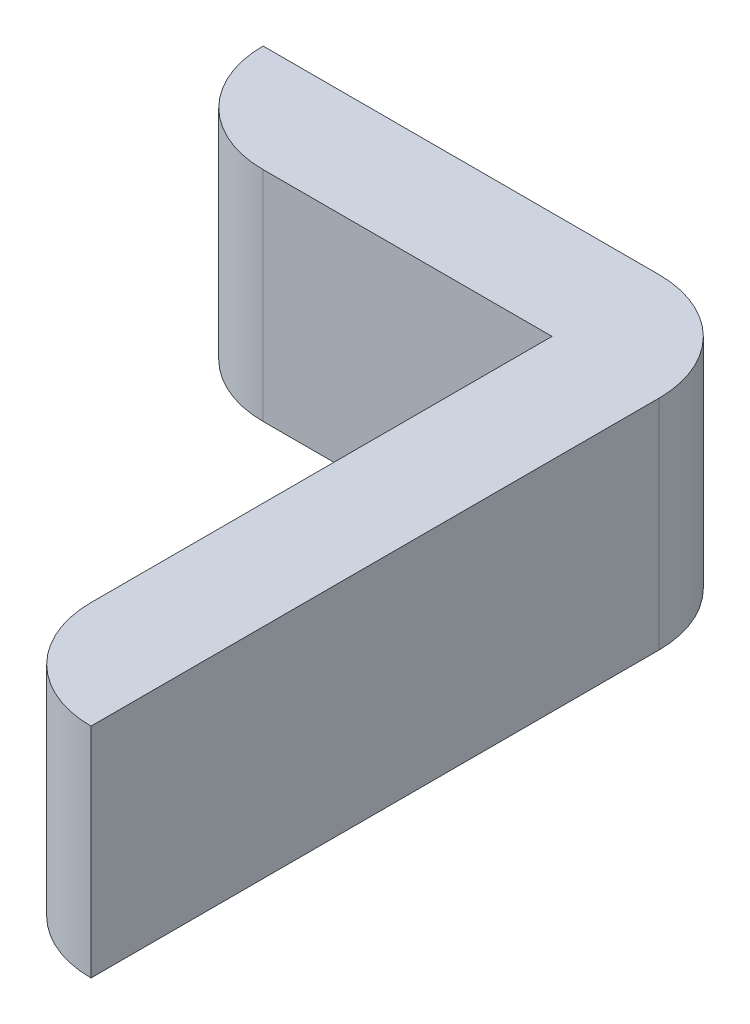
ISO-10303-21;
HEADER;
FILE_DESCRIPTION(('STEP AP214'),'2;1');
FILE_NAME('part.step','',(''),(''),'','','');
FILE_SCHEMA(('AUTOMOTIVE_DESIGN { 1 0 10303 214 1 1 1 1 }'));
ENDSEC;
DATA;
#1=APPLICATION_CONTEXT('core data for automotive mechanical design processes');
#2=APPLICATION_PROTOCOL_DEFINITION('international standard','automotive_design',2000,#1);
#3=PRODUCT_CONTEXT('',#1,'mechanical');
#4=PRODUCT('Part','Part','',(#3));
#5=PRODUCT_RELATED_PRODUCT_CATEGORY('part','',(#4));
#6=PRODUCT_DEFINITION_FORMATION('','',#4);
#7=PRODUCT_DEFINITION_CONTEXT('part definition',#1,'design');
#8=PRODUCT_DEFINITION('design','',#6,#7);
#9=PRODUCT_DEFINITION_SHAPE('','',#8);
#10=(LENGTH_UNIT() NAMED_UNIT(*) SI_UNIT(.MILLI.,.METRE.));
#11=(NAMED_UNIT(*) PLANE_ANGLE_UNIT() SI_UNIT($,.RADIAN.));
#12=(NAMED_UNIT(*) SI_UNIT($,.STERADIAN.) SOLID_ANGLE_UNIT());
#13=UNCERTAINTY_MEASURE_WITH_UNIT(LENGTH_MEASURE(1.E-05),#10,'distance_accuracy_value','');
#14=(GEOMETRIC_REPRESENTATION_CONTEXT(3) GLOBAL_UNCERTAINTY_ASSIGNED_CONTEXT((#13)) GLOBAL_UNIT_ASSIGNED_CONTEXT((#10,
#11,#12)) REPRESENTATION_CONTEXT('',''));
#15=CARTESIAN_POINT('',(0.,0.,0.));
#16=DIRECTION('',(0.,0.,1.));
#17=DIRECTION('',(1.,0.,0.));
#18=AXIS2_PLACEMENT_3D('',#15,#16,#17);
#19=CARTESIAN_POINT('',(9.275,1.5248,0.));
#20=DIRECTION('',(0.,-1.,0.));
#21=DIRECTION('',(0.,0.,-1.));
#22=AXIS2_PLACEMENT_3D('',#19,#20,#21);
#23=PLANE('',#22);
#24=DIRECTION('',(-1.,0.,0.));
#25=VECTOR('',#24,1.);
#26=CARTESIAN_POINT('',(9.525,1.5248,0.25));
#27=LINE('',#26,#25);
#28=CARTESIAN_POINT('',(9.525,1.5248,0.25));
#29=VERTEX_POINT('',#28);
#30=CARTESIAN_POINT('',(10.2,1.5248,0.25));
#31=VERTEX_POINT('',#30);
#32=EDGE_CURVE('E102',#29,#31,#27,.F.);
#33=ORIENTED_EDGE('',*,*,#32,.T.);
#34=DIRECTION('',(0.,0.,-1.));
#35=VECTOR('',#34,1.);
#36=CARTESIAN_POINT('',(10.2,1.5248,0.25));
#37=LINE('',#36,#35);
#38=CARTESIAN_POINT('',(10.2,1.5248,1.327));
#39=VERTEX_POINT('',#38);
#40=EDGE_CURVE('E108',#31,#39,#37,.F.);
#41=ORIENTED_EDGE('',*,*,#40,.T.);
#42=CARTESIAN_POINT('',(10.45,1.5248,1.327));
#43=DIRECTION('',(0.,-1.,0.));
#44=DIRECTION('',(0.,0.,-1.));
#45=AXIS2_PLACEMENT_3D('',#42,#43,#44);
#46=CIRCLE('',#45,0.25);
#47=CARTESIAN_POINT('',(10.45,1.5248,1.577));
#48=VERTEX_POINT('',#47);
#49=EDGE_CURVE('E80',#48,#39,#46,.T.);
#50=ORIENTED_EDGE('',*,*,#49,.F.);
#51=DIRECTION('',(0.,0.,1.));
#52=VECTOR('',#51,1.);
#53=CARTESIAN_POINT('',(10.45,1.5248,1.577));
#54=LINE('',#53,#52);
#55=CARTESIAN_POINT('',(10.45,1.5248,0.25));
#56=VERTEX_POINT('',#55);
#57=EDGE_CURVE('E75',#48,#56,#54,.F.);
#58=ORIENTED_EDGE('',*,*,#57,.T.);
#59=CARTESIAN_POINT('',(10.2,1.5248,0.25));
#60=DIRECTION('',(0.,-1.,0.));
#61=DIRECTION('',(0.,0.,-1.));
#62=AXIS2_PLACEMENT_3D('',#59,#60,#61);
#63=CIRCLE('',#62,0.25);
#64=CARTESIAN_POINT('',(10.2,1.5248,0.));
#65=VERTEX_POINT('',#64);
#66=EDGE_CURVE('E19',#65,#56,#63,.T.);
#67=ORIENTED_EDGE('',*,*,#66,.F.);
#68=DIRECTION('',(1.,0.,0.));
#69=VECTOR('',#68,1.);
#70=CARTESIAN_POINT('',(10.2,1.5248,0.));
#71=LINE('',#70,#69);
#72=CARTESIAN_POINT('',(9.275,1.5248,0.));
#73=VERTEX_POINT('',#72);
#74=EDGE_CURVE('E70',#65,#73,#71,.F.);
#75=ORIENTED_EDGE('',*,*,#74,.T.);
#76=CARTESIAN_POINT('',(9.525,1.5248,0.));
#77=DIRECTION('',(0.,-1.,0.));
#78=DIRECTION('',(0.,0.,-1.));
#79=AXIS2_PLACEMENT_3D('',#76,#77,#78);
#80=CIRCLE('',#79,0.25);
#81=EDGE_CURVE('E121',#29,#73,#80,.T.);
#82=ORIENTED_EDGE('',*,*,#81,.F.);
#83=EDGE_LOOP('',(#33,#41,#50,#58,#67,#75,#82));
#84=FACE_BOUND('',#83,.T.);
#85=ADVANCED_FACE('F16',(#84),#23,.F.);
#86=CARTESIAN_POINT('',(10.2,1.0152,0.));
#87=DIRECTION('',(0.,0.,1.));
#88=DIRECTION('',(1.,0.,0.));
#89=AXIS2_PLACEMENT_3D('',#86,#87,#88);
#90=PLANE('',#89);
#91=DIRECTION('',(0.,-1.,0.));
#92=VECTOR('',#91,1.);
#93=CARTESIAN_POINT('',(9.275,1.0152,0.));
#94=LINE('',#93,#92);
#95=CARTESIAN_POINT('',(9.275,1.0152,0.));
#96=VERTEX_POINT('',#95);
#97=EDGE_CURVE('E123',#73,#96,#94,.T.);
#98=ORIENTED_EDGE('',*,*,#97,.F.);
#99=ORIENTED_EDGE('',*,*,#74,.F.);
#100=DIRECTION('',(0.,-1.,0.));
#101=VECTOR('',#100,1.);
#102=CARTESIAN_POINT('',(10.2,1.0152,0.));
#103=LINE('',#102,#101);
#104=CARTESIAN_POINT('',(10.2,1.0152,0.));
#105=VERTEX_POINT('',#104);
#106=EDGE_CURVE('E92',#105,#65,#103,.F.);
#107=ORIENTED_EDGE('',*,*,#106,.F.);
#108=DIRECTION('',(1.,0.,0.));
#109=VECTOR('',#108,1.);
#110=CARTESIAN_POINT('',(9.275,1.0152,0.));
#111=LINE('',#110,#109);
#112=EDGE_CURVE('E120',#96,#105,#111,.T.);
#113=ORIENTED_EDGE('',*,*,#112,.F.);
#114=EDGE_LOOP('',(#98,#99,#107,#113));
#115=FACE_BOUND('',#114,.T.);
#116=ADVANCED_FACE('F158',(#115),#90,.F.);
#117=CARTESIAN_POINT('',(10.2,1.0152,0.25));
#118=DIRECTION('',(0.,-1.,0.));
#119=DIRECTION('',(0.,0.,-1.));
#120=AXIS2_PLACEMENT_3D('',#117,#118,#119);
#121=CYLINDRICAL_SURFACE('',#120,0.25);
#122=ORIENTED_EDGE('',*,*,#66,.T.);
#123=DIRECTION('',(0.,1.,0.));
#124=VECTOR('',#123,1.);
#125=CARTESIAN_POINT('',(10.45,1.0152,0.25));
#126=LINE('',#125,#124);
#127=CARTESIAN_POINT('',(10.45,1.0152,0.25));
#128=VERTEX_POINT('',#127);
#129=EDGE_CURVE('E86',#56,#128,#126,.F.);
#130=ORIENTED_EDGE('',*,*,#129,.T.);
#131=CARTESIAN_POINT('',(10.2,1.0152,0.25));
#132=DIRECTION('',(0.,-1.,0.));
#133=DIRECTION('',(0.,0.,-1.));
#134=AXIS2_PLACEMENT_3D('',#131,#132,#133);
#135=CIRCLE('',#134,0.25);
#136=EDGE_CURVE('E118',#105,#128,#135,.T.);
#137=ORIENTED_EDGE('',*,*,#136,.F.);
#138=ORIENTED_EDGE('',*,*,#106,.T.);
#139=EDGE_LOOP('',(#122,#130,#137,#138));
#140=FACE_BOUND('',#139,.T.);
#141=ADVANCED_FACE('F89',(#140),#121,.T.);
#142=CARTESIAN_POINT('',(10.45,1.0152,1.577));
#143=DIRECTION('',(-1.,0.,0.));
#144=DIRECTION('',(0.,0.,1.));
#145=AXIS2_PLACEMENT_3D('',#142,#143,#144);
#146=PLANE('',#145);
#147=DIRECTION('',(0.,-1.,0.));
#148=VECTOR('',#147,1.);
#149=CARTESIAN_POINT('',(10.45,1.0152,1.577));
#150=LINE('',#149,#148);
#151=CARTESIAN_POINT('',(10.45,1.0152,1.577));
#152=VERTEX_POINT('',#151);
#153=EDGE_CURVE('E85',#152,#48,#150,.F.);
#154=ORIENTED_EDGE('',*,*,#153,.F.);
#155=DIRECTION('',(0.,0.,-1.));
#156=VECTOR('',#155,1.);
#157=CARTESIAN_POINT('',(10.45,1.0152,0.));
#158=LINE('',#157,#156);
#159=EDGE_CURVE('E94',#128,#152,#158,.F.);
#160=ORIENTED_EDGE('',*,*,#159,.F.);
#161=ORIENTED_EDGE('',*,*,#129,.F.);
#162=ORIENTED_EDGE('',*,*,#57,.F.);
#163=EDGE_LOOP('',(#154,#160,#161,#162));
#164=FACE_BOUND('',#163,.T.);
#165=ADVANCED_FACE('F93',(#164),#146,.F.);
#166=CARTESIAN_POINT('',(10.45,1.0152,1.327));
#167=DIRECTION('',(0.,-1.,0.));
#168=DIRECTION('',(0.,0.,-1.));
#169=AXIS2_PLACEMENT_3D('',#166,#167,#168);
#170=CYLINDRICAL_SURFACE('',#169,0.25);
#171=ORIENTED_EDGE('',*,*,#49,.T.);
#172=DIRECTION('',(0.,1.,0.));
#173=VECTOR('',#172,1.);
#174=CARTESIAN_POINT('',(10.2,1.0152,1.327));
#175=LINE('',#174,#173);
#176=CARTESIAN_POINT('',(10.2,1.0152,1.327));
#177=VERTEX_POINT('',#176);
#178=EDGE_CURVE('E105',#39,#177,#175,.F.);
#179=ORIENTED_EDGE('',*,*,#178,.T.);
#180=CARTESIAN_POINT('',(10.45,1.0152,1.327));
#181=DIRECTION('',(0.,-1.,0.));
#182=DIRECTION('',(0.,0.,-1.));
#183=AXIS2_PLACEMENT_3D('',#180,#181,#182);
#184=CIRCLE('',#183,0.25);
#185=EDGE_CURVE('E114',#152,#177,#184,.T.);
#186=ORIENTED_EDGE('',*,*,#185,.F.);
#187=ORIENTED_EDGE('',*,*,#153,.T.);
#188=EDGE_LOOP('',(#171,#179,#186,#187));
#189=FACE_BOUND('',#188,.T.);
#190=ADVANCED_FACE('F127',(#189),#170,.T.);
#191=CARTESIAN_POINT('',(10.2,1.0152,0.25));
#192=DIRECTION('',(1.,0.,0.));
#193=DIRECTION('',(0.,0.,-1.));
#194=AXIS2_PLACEMENT_3D('',#191,#192,#193);
#195=PLANE('',#194);
#196=ORIENTED_EDGE('',*,*,#178,.F.);
#197=ORIENTED_EDGE('',*,*,#40,.F.);
#198=DIRECTION('',(0.,1.,0.));
#199=VECTOR('',#198,1.);
#200=CARTESIAN_POINT('',(10.2,1.0152,0.25));
#201=LINE('',#200,#199);
#202=CARTESIAN_POINT('',(10.2,1.0152,0.25));
#203=VERTEX_POINT('',#202);
#204=EDGE_CURVE('E104',#31,#203,#201,.F.);
#205=ORIENTED_EDGE('',*,*,#204,.T.);
#206=DIRECTION('',(0.,0.,-1.));
#207=VECTOR('',#206,1.);
#208=CARTESIAN_POINT('',(10.2,1.0152,0.));
#209=LINE('',#208,#207);
#210=EDGE_CURVE('E117',#177,#203,#209,.T.);
#211=ORIENTED_EDGE('',*,*,#210,.F.);
#212=EDGE_LOOP('',(#196,#197,#205,#211));
#213=FACE_BOUND('',#212,.T.);
#214=ADVANCED_FACE('F150',(#213),#195,.F.);
#215=CARTESIAN_POINT('',(9.525,1.0152,0.25));
#216=DIRECTION('',(0.,0.,-1.));
#217=DIRECTION('',(-1.,0.,0.));
#218=AXIS2_PLACEMENT_3D('',#215,#216,#217);
#219=PLANE('',#218);
#220=ORIENTED_EDGE('',*,*,#204,.F.);
#221=ORIENTED_EDGE('',*,*,#32,.F.);
#222=DIRECTION('',(0.,-1.,0.));
#223=VECTOR('',#222,1.);
#224=CARTESIAN_POINT('',(9.525,1.0152,0.25));
#225=LINE('',#224,#223);
#226=CARTESIAN_POINT('',(9.525,1.0152,0.25));
#227=VERTEX_POINT('',#226);
#228=EDGE_CURVE('E34',#227,#29,#225,.F.);
#229=ORIENTED_EDGE('',*,*,#228,.F.);
#230=DIRECTION('',(1.,0.,0.));
#231=VECTOR('',#230,1.);
#232=CARTESIAN_POINT('',(9.275,1.0152,0.25));
#233=LINE('',#232,#231);
#234=EDGE_CURVE('E25',#203,#227,#233,.F.);
#235=ORIENTED_EDGE('',*,*,#234,.F.);
#236=EDGE_LOOP('',(#220,#221,#229,#235));
#237=FACE_BOUND('',#236,.T.);
#238=ADVANCED_FACE('F151',(#237),#219,.F.);
#239=CARTESIAN_POINT('',(9.525,1.0152,0.));
#240=DIRECTION('',(0.,-1.,0.));
#241=DIRECTION('',(0.,0.,-1.));
#242=AXIS2_PLACEMENT_3D('',#239,#240,#241);
#243=CYLINDRICAL_SURFACE('',#242,0.25);
#244=ORIENTED_EDGE('',*,*,#81,.T.);
#245=ORIENTED_EDGE('',*,*,#97,.T.);
#246=CARTESIAN_POINT('',(9.525,1.0152,0.));
#247=DIRECTION('',(0.,-1.,0.));
#248=DIRECTION('',(0.,0.,-1.));
#249=AXIS2_PLACEMENT_3D('',#246,#247,#248);
#250=CIRCLE('',#249,0.25);
#251=EDGE_CURVE('E11',#227,#96,#250,.T.);
#252=ORIENTED_EDGE('',*,*,#251,.F.);
#253=ORIENTED_EDGE('',*,*,#228,.T.);
#254=EDGE_LOOP('',(#244,#245,#252,#253));
#255=FACE_BOUND('',#254,.T.);
#256=ADVANCED_FACE('F156',(#255),#243,.T.);
#257=CARTESIAN_POINT('',(9.275,1.0152,0.));
#258=DIRECTION('',(0.,-1.,0.));
#259=DIRECTION('',(0.,0.,-1.));
#260=AXIS2_PLACEMENT_3D('',#257,#258,#259);
#261=PLANE('',#260);
#262=ORIENTED_EDGE('',*,*,#234,.T.);
#263=ORIENTED_EDGE('',*,*,#251,.T.);
#264=ORIENTED_EDGE('',*,*,#112,.T.);
#265=ORIENTED_EDGE('',*,*,#136,.T.);
#266=ORIENTED_EDGE('',*,*,#159,.T.);
#267=ORIENTED_EDGE('',*,*,#185,.T.);
#268=ORIENTED_EDGE('',*,*,#210,.T.);
#269=EDGE_LOOP('',(#262,#263,#264,#265,#266,#267,#268));
#270=FACE_BOUND('',#269,.T.);
#271=ADVANCED_FACE('F132',(#270),#261,.T.);
#272=CLOSED_SHELL('',(#85,#116,#141,#165,#190,#214,#238,#256,#271));
#273=MANIFOLD_SOLID_BREP('B1',#272);
#274=ADVANCED_BREP_SHAPE_REPRESENTATION('',(#18,#273),#14);
#275=SHAPE_DEFINITION_REPRESENTATION(#9,#274);
ENDSEC;
END-ISO-10303-21;
